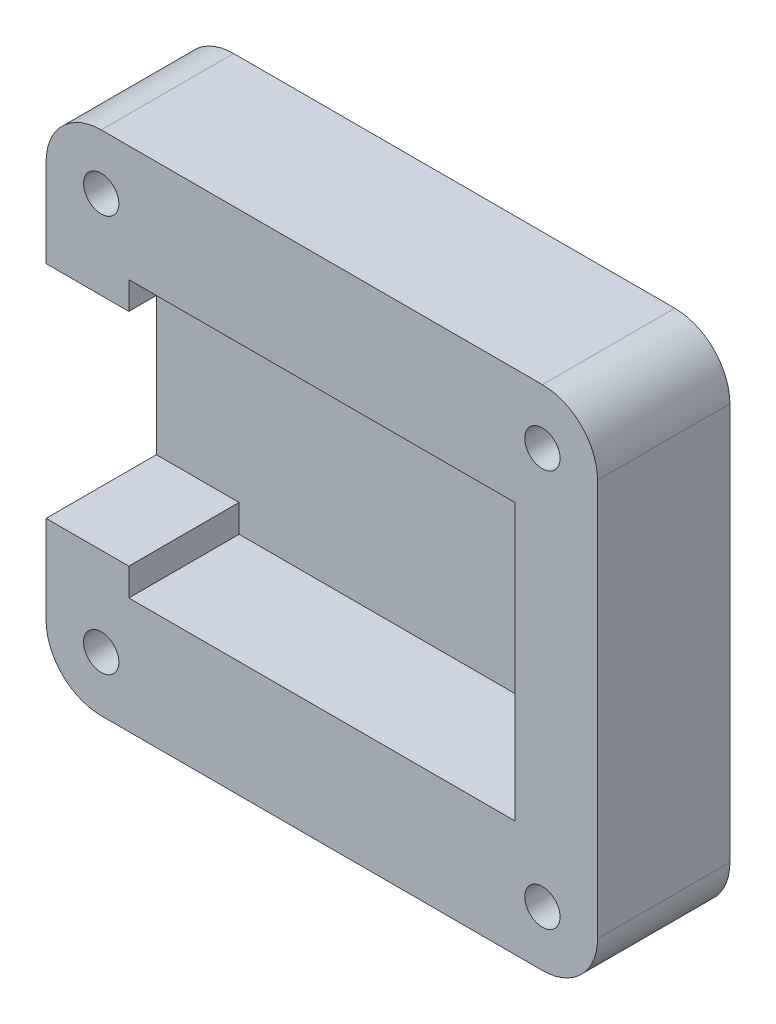
ISO-10303-21;
HEADER;
FILE_DESCRIPTION(('STEP AP214'),'2;1');
FILE_NAME('part.step','',(''),(''),'','','');
FILE_SCHEMA(('AUTOMOTIVE_DESIGN { 1 0 10303 214 1 1 1 1 }'));
ENDSEC;
DATA;
#1=APPLICATION_CONTEXT('core data for automotive mechanical design processes');
#2=APPLICATION_PROTOCOL_DEFINITION('international standard','automotive_design',2000,#1);
#3=PRODUCT_CONTEXT('',#1,'mechanical');
#4=PRODUCT('Part','Part','',(#3));
#5=PRODUCT_RELATED_PRODUCT_CATEGORY('part','',(#4));
#6=PRODUCT_DEFINITION_FORMATION('','',#4);
#7=PRODUCT_DEFINITION_CONTEXT('part definition',#1,'design');
#8=PRODUCT_DEFINITION('design','',#6,#7);
#9=PRODUCT_DEFINITION_SHAPE('','',#8);
#10=(LENGTH_UNIT() NAMED_UNIT(*) SI_UNIT(.MILLI.,.METRE.));
#11=(NAMED_UNIT(*) PLANE_ANGLE_UNIT() SI_UNIT($,.RADIAN.));
#12=(NAMED_UNIT(*) SI_UNIT($,.STERADIAN.) SOLID_ANGLE_UNIT());
#13=UNCERTAINTY_MEASURE_WITH_UNIT(LENGTH_MEASURE(1.E-05),#10,'distance_accuracy_value','');
#14=(GEOMETRIC_REPRESENTATION_CONTEXT(3) GLOBAL_UNCERTAINTY_ASSIGNED_CONTEXT((#13)) GLOBAL_UNIT_ASSIGNED_CONTEXT((#10,
#11,#12)) REPRESENTATION_CONTEXT('',''));
#15=CARTESIAN_POINT('',(0.,0.,0.));
#16=DIRECTION('',(0.,0.,1.));
#17=DIRECTION('',(1.,0.,0.));
#18=AXIS2_PLACEMENT_3D('',#15,#16,#17);
#19=CARTESIAN_POINT('',(-8.75,6.25,-5.));
#20=DIRECTION('',(-1.,0.,0.));
#21=DIRECTION('',(0.,0.,1.));
#22=AXIS2_PLACEMENT_3D('',#19,#20,#21);
#23=PLANE('',#22);
#24=DIRECTION('',(0.,-1.,0.));
#25=VECTOR('',#24,1.);
#26=CARTESIAN_POINT('',(-8.75,6.25,-5.));
#27=LINE('',#26,#25);
#28=CARTESIAN_POINT('',(-8.75,-5.,-5.));
#29=VERTEX_POINT('',#28);
#30=CARTESIAN_POINT('',(-8.75,-6.25,-5.));
#31=VERTEX_POINT('',#30);
#32=EDGE_CURVE('E198',#29,#31,#27,.T.);
#33=ORIENTED_EDGE('',*,*,#32,.F.);
#34=DIRECTION('',(0.,0.,1.));
#35=VECTOR('',#34,1.);
#36=CARTESIAN_POINT('',(-8.75,-5.,-15.6800046816469));
#37=LINE('',#36,#35);
#38=CARTESIAN_POINT('',(-8.75,-5.,0.));
#39=VERTEX_POINT('',#38);
#40=EDGE_CURVE('E184',#29,#39,#37,.T.);
#41=ORIENTED_EDGE('',*,*,#40,.T.);
#42=DIRECTION('',(0.,-1.,0.));
#43=VECTOR('',#42,1.);
#44=CARTESIAN_POINT('',(-8.75,6.25,0.));
#45=LINE('',#44,#43);
#46=CARTESIAN_POINT('',(-8.75,-6.25,0.));
#47=VERTEX_POINT('',#46);
#48=EDGE_CURVE('E211',#39,#47,#45,.T.);
#49=ORIENTED_EDGE('',*,*,#48,.T.);
#50=DIRECTION('',(0.,0.,1.));
#51=VECTOR('',#50,1.);
#52=CARTESIAN_POINT('',(-8.75,-6.25,-5.));
#53=LINE('',#52,#51);
#54=EDGE_CURVE('E215',#31,#47,#53,.T.);
#55=ORIENTED_EDGE('',*,*,#54,.F.);
#56=EDGE_LOOP('',(#33,#41,#49,#55));
#57=FACE_BOUND('',#56,.T.);
#58=ADVANCED_FACE('F35',(#57),#23,.F.);
#59=CARTESIAN_POINT('',(0.,0.,0.));
#60=DIRECTION('',(0.,0.,1.));
#61=DIRECTION('',(1.,0.,0.));
#62=AXIS2_PLACEMENT_3D('',#59,#60,#61);
#63=PLANE('',#62);
#64=CARTESIAN_POINT('',(10.,9.,0.));
#65=DIRECTION('',(0.,0.,-1.));
#66=DIRECTION('',(-1.,0.,0.));
#67=AXIS2_PLACEMENT_3D('',#64,#65,#66);
#68=CIRCLE('',#67,0.799999999999999);
#69=CARTESIAN_POINT('',(9.2,9.,0.));
#70=VERTEX_POINT('',#69);
#71=EDGE_CURVE('E582',#70,#70,#68,.T.);
#72=ORIENTED_EDGE('',*,*,#71,.T.);
#73=EDGE_LOOP('',(#72));
#74=FACE_BOUND('',#73,.T.);
#75=CARTESIAN_POINT('',(-10.,9.,0.));
#76=DIRECTION('',(0.,0.,-1.));
#77=DIRECTION('',(-1.,0.,0.));
#78=AXIS2_PLACEMENT_3D('',#75,#76,#77);
#79=CIRCLE('',#78,0.799999999999999);
#80=CARTESIAN_POINT('',(-10.8,9.,0.));
#81=VERTEX_POINT('',#80);
#82=EDGE_CURVE('E573',#81,#81,#79,.T.);
#83=ORIENTED_EDGE('',*,*,#82,.T.);
#84=EDGE_LOOP('',(#83));
#85=FACE_BOUND('',#84,.T.);
#86=CARTESIAN_POINT('',(-10.,-9.,0.));
#87=DIRECTION('',(0.,0.,-1.));
#88=DIRECTION('',(-1.,0.,0.));
#89=AXIS2_PLACEMENT_3D('',#86,#87,#88);
#90=CIRCLE('',#89,0.799999999999999);
#91=CARTESIAN_POINT('',(-10.8,-9.,0.));
#92=VERTEX_POINT('',#91);
#93=EDGE_CURVE('E562',#92,#92,#90,.T.);
#94=ORIENTED_EDGE('',*,*,#93,.T.);
#95=EDGE_LOOP('',(#94));
#96=FACE_BOUND('',#95,.T.);
#97=CARTESIAN_POINT('',(10.,-9.,0.));
#98=DIRECTION('',(0.,0.,-1.));
#99=DIRECTION('',(-1.,0.,0.));
#100=AXIS2_PLACEMENT_3D('',#97,#98,#99);
#101=CIRCLE('',#100,0.799999999999999);
#102=CARTESIAN_POINT('',(9.2,-9.,0.));
#103=VERTEX_POINT('',#102);
#104=EDGE_CURVE('E294',#103,#103,#101,.T.);
#105=ORIENTED_EDGE('',*,*,#104,.T.);
#106=EDGE_LOOP('',(#105));
#107=FACE_BOUND('',#106,.T.);
#108=DIRECTION('',(1.,0.,0.));
#109=VECTOR('',#108,1.);
#110=CARTESIAN_POINT('',(-12.5,11.5,0.));
#111=LINE('',#110,#109);
#112=CARTESIAN_POINT('',(-10.,11.5,0.));
#113=VERTEX_POINT('',#112);
#114=CARTESIAN_POINT('',(9.99999999999999,11.5,0.));
#115=VERTEX_POINT('',#114);
#116=EDGE_CURVE('E227',#113,#115,#111,.T.);
#117=ORIENTED_EDGE('',*,*,#116,.F.);
#118=CARTESIAN_POINT('',(-10.,9.00000000000001,0.));
#119=DIRECTION('',(0.,0.,1.));
#120=DIRECTION('',(1.,0.,0.));
#121=AXIS2_PLACEMENT_3D('',#118,#119,#120);
#122=CIRCLE('',#121,2.5);
#123=CARTESIAN_POINT('',(-12.5,9.00000000000001,0.));
#124=VERTEX_POINT('',#123);
#125=EDGE_CURVE('E156',#113,#124,#122,.T.);
#126=ORIENTED_EDGE('',*,*,#125,.T.);
#127=DIRECTION('',(0.,-1.,0.));
#128=VECTOR('',#127,1.);
#129=CARTESIAN_POINT('',(-12.5,11.5,0.));
#130=LINE('',#129,#128);
#131=CARTESIAN_POINT('',(-12.5,5.,0.));
#132=VERTEX_POINT('',#131);
#133=EDGE_CURVE('E149',#124,#132,#130,.T.);
#134=ORIENTED_EDGE('',*,*,#133,.T.);
#135=DIRECTION('',(-1.,0.,0.));
#136=VECTOR('',#135,1.);
#137=CARTESIAN_POINT('',(-12.5,5.,0.));
#138=LINE('',#137,#136);
#139=CARTESIAN_POINT('',(-8.75,5.,0.));
#140=VERTEX_POINT('',#139);
#141=EDGE_CURVE('E154',#140,#132,#138,.T.);
#142=ORIENTED_EDGE('',*,*,#141,.F.);
#143=CARTESIAN_POINT('',(-8.75,6.25,0.));
#144=VERTEX_POINT('',#143);
#145=EDGE_CURVE('E193',#144,#140,#45,.T.);
#146=ORIENTED_EDGE('',*,*,#145,.F.);
#147=DIRECTION('',(1.,0.,0.));
#148=VECTOR('',#147,1.);
#149=CARTESIAN_POINT('',(-8.75,6.25,0.));
#150=LINE('',#149,#148);
#151=CARTESIAN_POINT('',(8.75,6.25,0.));
#152=VERTEX_POINT('',#151);
#153=EDGE_CURVE('E188',#144,#152,#150,.T.);
#154=ORIENTED_EDGE('',*,*,#153,.T.);
#155=DIRECTION('',(0.,-1.,0.));
#156=VECTOR('',#155,1.);
#157=CARTESIAN_POINT('',(8.75,6.25,0.));
#158=LINE('',#157,#156);
#159=CARTESIAN_POINT('',(8.75,-6.25,0.));
#160=VERTEX_POINT('',#159);
#161=EDGE_CURVE('E205',#152,#160,#158,.T.);
#162=ORIENTED_EDGE('',*,*,#161,.T.);
#163=DIRECTION('',(1.,0.,0.));
#164=VECTOR('',#163,1.);
#165=CARTESIAN_POINT('',(-8.75,-6.25,0.));
#166=LINE('',#165,#164);
#167=EDGE_CURVE('E208',#47,#160,#166,.T.);
#168=ORIENTED_EDGE('',*,*,#167,.F.);
#169=ORIENTED_EDGE('',*,*,#48,.F.);
#170=DIRECTION('',(1.,0.,0.));
#171=VECTOR('',#170,1.);
#172=CARTESIAN_POINT('',(-12.5,-5.,0.));
#173=LINE('',#172,#171);
#174=CARTESIAN_POINT('',(-12.5,-5.,0.));
#175=VERTEX_POINT('',#174);
#176=EDGE_CURVE('E170',#175,#39,#173,.T.);
#177=ORIENTED_EDGE('',*,*,#176,.F.);
#178=CARTESIAN_POINT('',(-12.5,-9.00000000000001,0.));
#179=VERTEX_POINT('',#178);
#180=EDGE_CURVE('E161',#175,#179,#130,.T.);
#181=ORIENTED_EDGE('',*,*,#180,.T.);
#182=CARTESIAN_POINT('',(-10.,-9.00000000000001,0.));
#183=DIRECTION('',(0.,0.,1.));
#184=DIRECTION('',(1.,0.,0.));
#185=AXIS2_PLACEMENT_3D('',#182,#183,#184);
#186=CIRCLE('',#185,2.5);
#187=CARTESIAN_POINT('',(-10.,-11.5,0.));
#188=VERTEX_POINT('',#187);
#189=EDGE_CURVE('E250',#179,#188,#186,.T.);
#190=ORIENTED_EDGE('',*,*,#189,.T.);
#191=DIRECTION('',(1.,0.,0.));
#192=VECTOR('',#191,1.);
#193=CARTESIAN_POINT('',(-12.5,-11.5,0.));
#194=LINE('',#193,#192);
#195=CARTESIAN_POINT('',(9.99999999999999,-11.5,0.));
#196=VERTEX_POINT('',#195);
#197=EDGE_CURVE('E160',#188,#196,#194,.T.);
#198=ORIENTED_EDGE('',*,*,#197,.T.);
#199=CARTESIAN_POINT('',(10.,-9.00000000000001,0.));
#200=DIRECTION('',(0.,0.,1.));
#201=DIRECTION('',(1.,0.,0.));
#202=AXIS2_PLACEMENT_3D('',#199,#200,#201);
#203=CIRCLE('',#202,2.5);
#204=CARTESIAN_POINT('',(12.5,-9.00000000000001,0.));
#205=VERTEX_POINT('',#204);
#206=EDGE_CURVE('E248',#196,#205,#203,.T.);
#207=ORIENTED_EDGE('',*,*,#206,.T.);
#208=DIRECTION('',(0.,-1.,0.));
#209=VECTOR('',#208,1.);
#210=CARTESIAN_POINT('',(12.5,11.5,0.));
#211=LINE('',#210,#209);
#212=CARTESIAN_POINT('',(12.5,9.00000000000001,0.));
#213=VERTEX_POINT('',#212);
#214=EDGE_CURVE('E237',#213,#205,#211,.T.);
#215=ORIENTED_EDGE('',*,*,#214,.F.);
#216=CARTESIAN_POINT('',(10.,9.00000000000001,0.));
#217=DIRECTION('',(0.,0.,1.));
#218=DIRECTION('',(1.,0.,0.));
#219=AXIS2_PLACEMENT_3D('',#216,#217,#218);
#220=CIRCLE('',#219,2.5);
#221=EDGE_CURVE('E246',#213,#115,#220,.T.);
#222=ORIENTED_EDGE('',*,*,#221,.T.);
#223=EDGE_LOOP('',(#117,#126,#134,#142,#146,#154,#162,#168,#169,#177,#181,#190,#198,#207,#215,#222));
#224=FACE_BOUND('',#223,.T.);
#225=ADVANCED_FACE('F152',(#74,#85,#96,#107,#224),#63,.T.);
#226=CARTESIAN_POINT('',(-12.5,11.5,-6.));
#227=DIRECTION('',(-1.,0.,0.));
#228=DIRECTION('',(0.,0.,1.));
#229=AXIS2_PLACEMENT_3D('',#226,#227,#228);
#230=PLANE('',#229);
#231=ORIENTED_EDGE('',*,*,#133,.F.);
#232=DIRECTION('',(0.,0.,1.));
#233=VECTOR('',#232,1.);
#234=CARTESIAN_POINT('',(-12.5,9.00000000000001,-6.));
#235=LINE('',#234,#233);
#236=CARTESIAN_POINT('',(-12.5,9.00000000000001,-6.));
#237=VERTEX_POINT('',#236);
#238=EDGE_CURVE('E256',#124,#237,#235,.F.);
#239=ORIENTED_EDGE('',*,*,#238,.T.);
#240=DIRECTION('',(0.,-1.,0.));
#241=VECTOR('',#240,1.);
#242=CARTESIAN_POINT('',(-12.5,11.5,-6.));
#243=LINE('',#242,#241);
#244=CARTESIAN_POINT('',(-12.5,-9.00000000000001,-6.));
#245=VERTEX_POINT('',#244);
#246=EDGE_CURVE('E223',#237,#245,#243,.T.);
#247=ORIENTED_EDGE('',*,*,#246,.T.);
#248=DIRECTION('',(0.,0.,1.));
#249=VECTOR('',#248,1.);
#250=CARTESIAN_POINT('',(-12.5,-9.00000000000001,-6.));
#251=LINE('',#250,#249);
#252=EDGE_CURVE('E253',#245,#179,#251,.T.);
#253=ORIENTED_EDGE('',*,*,#252,.T.);
#254=ORIENTED_EDGE('',*,*,#180,.F.);
#255=DIRECTION('',(0.,0.,1.));
#256=VECTOR('',#255,1.);
#257=CARTESIAN_POINT('',(-12.5,-5.,-15.6800046816469));
#258=LINE('',#257,#256);
#259=CARTESIAN_POINT('',(-12.5,-5.,-5.));
#260=VERTEX_POINT('',#259);
#261=EDGE_CURVE('E179',#260,#175,#258,.T.);
#262=ORIENTED_EDGE('',*,*,#261,.F.);
#263=DIRECTION('',(0.,-1.,0.));
#264=VECTOR('',#263,1.);
#265=CARTESIAN_POINT('',(-12.5,5.,-5.));
#266=LINE('',#265,#264);
#267=CARTESIAN_POINT('',(-12.5,5.,-5.));
#268=VERTEX_POINT('',#267);
#269=EDGE_CURVE('E176',#268,#260,#266,.T.);
#270=ORIENTED_EDGE('',*,*,#269,.F.);
#271=DIRECTION('',(0.,0.,1.));
#272=VECTOR('',#271,1.);
#273=CARTESIAN_POINT('',(-12.5,5.,-15.6800046816469));
#274=LINE('',#273,#272);
#275=EDGE_CURVE('E165',#268,#132,#274,.T.);
#276=ORIENTED_EDGE('',*,*,#275,.T.);
#277=EDGE_LOOP('',(#231,#239,#247,#253,#254,#262,#270,#276));
#278=FACE_BOUND('',#277,.T.);
#279=ADVANCED_FACE('F173',(#278),#230,.T.);
#280=CARTESIAN_POINT('',(-12.5,11.5,-6.));
#281=DIRECTION('',(0.,-1.,0.));
#282=DIRECTION('',(0.,0.,-1.));
#283=AXIS2_PLACEMENT_3D('',#280,#281,#282);
#284=PLANE('',#283);
#285=DIRECTION('',(1.,0.,0.));
#286=VECTOR('',#285,1.);
#287=CARTESIAN_POINT('',(-12.5,11.5,-6.));
#288=LINE('',#287,#286);
#289=CARTESIAN_POINT('',(-10.,11.5,-6.));
#290=VERTEX_POINT('',#289);
#291=CARTESIAN_POINT('',(9.99999999999999,11.5,-6.));
#292=VERTEX_POINT('',#291);
#293=EDGE_CURVE('E231',#290,#292,#288,.T.);
#294=ORIENTED_EDGE('',*,*,#293,.F.);
#295=DIRECTION('',(0.,0.,1.));
#296=VECTOR('',#295,1.);
#297=CARTESIAN_POINT('',(-10.,11.5,0.));
#298=LINE('',#297,#296);
#299=EDGE_CURVE('E243',#290,#113,#298,.T.);
#300=ORIENTED_EDGE('',*,*,#299,.T.);
#301=ORIENTED_EDGE('',*,*,#116,.T.);
#302=DIRECTION('',(0.,0.,1.));
#303=VECTOR('',#302,1.);
#304=CARTESIAN_POINT('',(10.,11.5,-6.));
#305=LINE('',#304,#303);
#306=EDGE_CURVE('E233',#115,#292,#305,.F.);
#307=ORIENTED_EDGE('',*,*,#306,.T.);
#308=EDGE_LOOP('',(#294,#300,#301,#307));
#309=FACE_BOUND('',#308,.T.);
#310=ADVANCED_FACE('F336',(#309),#284,.F.);
#311=CARTESIAN_POINT('',(12.5,11.5,-6.));
#312=DIRECTION('',(-1.,0.,0.));
#313=DIRECTION('',(0.,0.,1.));
#314=AXIS2_PLACEMENT_3D('',#311,#312,#313);
#315=PLANE('',#314);
#316=ORIENTED_EDGE('',*,*,#214,.T.);
#317=DIRECTION('',(0.,0.,1.));
#318=VECTOR('',#317,1.);
#319=CARTESIAN_POINT('',(12.5,-9.00000000000001,-6.));
#320=LINE('',#319,#318);
#321=CARTESIAN_POINT('',(12.5,-9.00000000000001,-6.));
#322=VERTEX_POINT('',#321);
#323=EDGE_CURVE('E11',#205,#322,#320,.F.);
#324=ORIENTED_EDGE('',*,*,#323,.T.);
#325=DIRECTION('',(0.,-1.,0.));
#326=VECTOR('',#325,1.);
#327=CARTESIAN_POINT('',(12.5,11.5,-6.));
#328=LINE('',#327,#326);
#329=CARTESIAN_POINT('',(12.5,9.00000000000001,-6.));
#330=VERTEX_POINT('',#329);
#331=EDGE_CURVE('E229',#330,#322,#328,.T.);
#332=ORIENTED_EDGE('',*,*,#331,.F.);
#333=DIRECTION('',(0.,0.,1.));
#334=VECTOR('',#333,1.);
#335=CARTESIAN_POINT('',(12.5,9.00000000000001,-6.));
#336=LINE('',#335,#334);
#337=EDGE_CURVE('E43',#330,#213,#336,.T.);
#338=ORIENTED_EDGE('',*,*,#337,.T.);
#339=EDGE_LOOP('',(#316,#324,#332,#338));
#340=FACE_BOUND('',#339,.T.);
#341=ADVANCED_FACE('F273',(#340),#315,.F.);
#342=CARTESIAN_POINT('',(-12.5,-11.5,-6.));
#343=DIRECTION('',(0.,-1.,0.));
#344=DIRECTION('',(0.,0.,-1.));
#345=AXIS2_PLACEMENT_3D('',#342,#343,#344);
#346=PLANE('',#345);
#347=ORIENTED_EDGE('',*,*,#197,.F.);
#348=DIRECTION('',(0.,0.,1.));
#349=VECTOR('',#348,1.);
#350=CARTESIAN_POINT('',(-10.,-11.5,-6.));
#351=LINE('',#350,#349);
#352=CARTESIAN_POINT('',(-10.,-11.5,-6.));
#353=VERTEX_POINT('',#352);
#354=EDGE_CURVE('E57',#188,#353,#351,.F.);
#355=ORIENTED_EDGE('',*,*,#354,.T.);
#356=DIRECTION('',(1.,0.,0.));
#357=VECTOR('',#356,1.);
#358=CARTESIAN_POINT('',(-12.5,-11.5,-6.));
#359=LINE('',#358,#357);
#360=CARTESIAN_POINT('',(9.99999999999999,-11.5,-6.));
#361=VERTEX_POINT('',#360);
#362=EDGE_CURVE('E226',#353,#361,#359,.T.);
#363=ORIENTED_EDGE('',*,*,#362,.T.);
#364=DIRECTION('',(0.,0.,1.));
#365=VECTOR('',#364,1.);
#366=CARTESIAN_POINT('',(10.,-11.5,0.));
#367=LINE('',#366,#365);
#368=EDGE_CURVE('E265',#361,#196,#367,.T.);
#369=ORIENTED_EDGE('',*,*,#368,.T.);
#370=EDGE_LOOP('',(#347,#355,#363,#369));
#371=FACE_BOUND('',#370,.T.);
#372=ADVANCED_FACE('F280',(#371),#346,.T.);
#373=CARTESIAN_POINT('',(0.,0.,-6.));
#374=DIRECTION('',(0.,0.,1.));
#375=DIRECTION('',(1.,0.,0.));
#376=AXIS2_PLACEMENT_3D('',#373,#374,#375);
#377=PLANE('',#376);
#378=CARTESIAN_POINT('',(10.,9.,-6.));
#379=DIRECTION('',(0.,0.,-1.));
#380=DIRECTION('',(-1.,0.,0.));
#381=AXIS2_PLACEMENT_3D('',#378,#379,#380);
#382=CIRCLE('',#381,1.75);
#383=CARTESIAN_POINT('',(8.25,9.,-6.));
#384=VERTEX_POINT('',#383);
#385=EDGE_CURVE('E587',#384,#384,#382,.T.);
#386=ORIENTED_EDGE('',*,*,#385,.F.);
#387=EDGE_LOOP('',(#386));
#388=FACE_BOUND('',#387,.T.);
#389=CARTESIAN_POINT('',(-10.,9.,-6.));
#390=DIRECTION('',(0.,0.,-1.));
#391=DIRECTION('',(-1.,0.,0.));
#392=AXIS2_PLACEMENT_3D('',#389,#390,#391);
#393=CIRCLE('',#392,1.75);
#394=CARTESIAN_POINT('',(-11.75,9.,-6.));
#395=VERTEX_POINT('',#394);
#396=EDGE_CURVE('E579',#395,#395,#393,.T.);
#397=ORIENTED_EDGE('',*,*,#396,.F.);
#398=EDGE_LOOP('',(#397));
#399=FACE_BOUND('',#398,.T.);
#400=CARTESIAN_POINT('',(-10.,-9.,-6.));
#401=DIRECTION('',(0.,0.,-1.));
#402=DIRECTION('',(-1.,0.,0.));
#403=AXIS2_PLACEMENT_3D('',#400,#401,#402);
#404=CIRCLE('',#403,1.75);
#405=CARTESIAN_POINT('',(-11.75,-9.,-6.));
#406=VERTEX_POINT('',#405);
#407=EDGE_CURVE('E570',#406,#406,#404,.T.);
#408=ORIENTED_EDGE('',*,*,#407,.F.);
#409=EDGE_LOOP('',(#408));
#410=FACE_BOUND('',#409,.T.);
#411=CARTESIAN_POINT('',(10.,-9.,-6.));
#412=DIRECTION('',(0.,0.,-1.));
#413=DIRECTION('',(-1.,0.,0.));
#414=AXIS2_PLACEMENT_3D('',#411,#412,#413);
#415=CIRCLE('',#414,1.75);
#416=CARTESIAN_POINT('',(8.25,-9.,-6.));
#417=VERTEX_POINT('',#416);
#418=EDGE_CURVE('E559',#417,#417,#415,.T.);
#419=ORIENTED_EDGE('',*,*,#418,.F.);
#420=EDGE_LOOP('',(#419));
#421=FACE_BOUND('',#420,.T.);
#422=ORIENTED_EDGE('',*,*,#246,.F.);
#423=CARTESIAN_POINT('',(-10.,9.00000000000001,-6.));
#424=DIRECTION('',(0.,0.,1.));
#425=DIRECTION('',(1.,0.,0.));
#426=AXIS2_PLACEMENT_3D('',#423,#424,#425);
#427=CIRCLE('',#426,2.5);
#428=EDGE_CURVE('E263',#237,#290,#427,.F.);
#429=ORIENTED_EDGE('',*,*,#428,.T.);
#430=ORIENTED_EDGE('',*,*,#293,.T.);
#431=CARTESIAN_POINT('',(10.,9.00000000000001,-6.));
#432=DIRECTION('',(0.,0.,1.));
#433=DIRECTION('',(1.,0.,0.));
#434=AXIS2_PLACEMENT_3D('',#431,#432,#433);
#435=CIRCLE('',#434,2.5);
#436=EDGE_CURVE('E258',#292,#330,#435,.F.);
#437=ORIENTED_EDGE('',*,*,#436,.T.);
#438=ORIENTED_EDGE('',*,*,#331,.T.);
#439=CARTESIAN_POINT('',(10.,-9.00000000000001,-6.));
#440=DIRECTION('',(0.,0.,1.));
#441=DIRECTION('',(1.,0.,0.));
#442=AXIS2_PLACEMENT_3D('',#439,#440,#441);
#443=CIRCLE('',#442,2.5);
#444=EDGE_CURVE('E50',#322,#361,#443,.F.);
#445=ORIENTED_EDGE('',*,*,#444,.T.);
#446=ORIENTED_EDGE('',*,*,#362,.F.);
#447=CARTESIAN_POINT('',(-10.,-9.00000000000001,-6.));
#448=DIRECTION('',(0.,0.,1.));
#449=DIRECTION('',(1.,0.,0.));
#450=AXIS2_PLACEMENT_3D('',#447,#448,#449);
#451=CIRCLE('',#450,2.5);
#452=EDGE_CURVE('E261',#353,#245,#451,.F.);
#453=ORIENTED_EDGE('',*,*,#452,.T.);
#454=EDGE_LOOP('',(#422,#429,#430,#437,#438,#445,#446,#453));
#455=FACE_BOUND('',#454,.T.);
#456=ADVANCED_FACE('F283',(#388,#399,#410,#421,#455),#377,.F.);
#457=CARTESIAN_POINT('',(-8.75,6.25,-5.));
#458=DIRECTION('',(0.,-1.,0.));
#459=DIRECTION('',(0.,0.,-1.));
#460=AXIS2_PLACEMENT_3D('',#457,#458,#459);
#461=PLANE('',#460);
#462=ORIENTED_EDGE('',*,*,#153,.F.);
#463=DIRECTION('',(0.,0.,1.));
#464=VECTOR('',#463,1.);
#465=CARTESIAN_POINT('',(-8.75,6.25,-5.));
#466=LINE('',#465,#464);
#467=CARTESIAN_POINT('',(-8.75,6.25,-5.));
#468=VERTEX_POINT('',#467);
#469=EDGE_CURVE('E202',#468,#144,#466,.T.);
#470=ORIENTED_EDGE('',*,*,#469,.F.);
#471=DIRECTION('',(1.,0.,0.));
#472=VECTOR('',#471,1.);
#473=CARTESIAN_POINT('',(-8.75,6.25,-5.));
#474=LINE('',#473,#472);
#475=CARTESIAN_POINT('',(8.75,6.25,-5.));
#476=VERTEX_POINT('',#475);
#477=EDGE_CURVE('E189',#468,#476,#474,.T.);
#478=ORIENTED_EDGE('',*,*,#477,.T.);
#479=DIRECTION('',(0.,0.,1.));
#480=VECTOR('',#479,1.);
#481=CARTESIAN_POINT('',(8.75,6.25,-5.));
#482=LINE('',#481,#480);
#483=EDGE_CURVE('E220',#476,#152,#482,.T.);
#484=ORIENTED_EDGE('',*,*,#483,.T.);
#485=EDGE_LOOP('',(#462,#470,#478,#484));
#486=FACE_BOUND('',#485,.T.);
#487=ADVANCED_FACE('F315',(#486),#461,.T.);
#488=CARTESIAN_POINT('',(8.75,6.25,-5.));
#489=DIRECTION('',(-1.,0.,0.));
#490=DIRECTION('',(0.,0.,1.));
#491=AXIS2_PLACEMENT_3D('',#488,#489,#490);
#492=PLANE('',#491);
#493=ORIENTED_EDGE('',*,*,#161,.F.);
#494=ORIENTED_EDGE('',*,*,#483,.F.);
#495=DIRECTION('',(0.,-1.,0.));
#496=VECTOR('',#495,1.);
#497=CARTESIAN_POINT('',(8.75,6.25,-5.));
#498=LINE('',#497,#496);
#499=CARTESIAN_POINT('',(8.75,-6.25,-5.));
#500=VERTEX_POINT('',#499);
#501=EDGE_CURVE('E192',#476,#500,#498,.T.);
#502=ORIENTED_EDGE('',*,*,#501,.T.);
#503=DIRECTION('',(0.,0.,1.));
#504=VECTOR('',#503,1.);
#505=CARTESIAN_POINT('',(8.75,-6.25,-5.));
#506=LINE('',#505,#504);
#507=EDGE_CURVE('E218',#500,#160,#506,.T.);
#508=ORIENTED_EDGE('',*,*,#507,.T.);
#509=EDGE_LOOP('',(#493,#494,#502,#508));
#510=FACE_BOUND('',#509,.T.);
#511=ADVANCED_FACE('F316',(#510),#492,.T.);
#512=CARTESIAN_POINT('',(-8.75,-6.25,-5.));
#513=DIRECTION('',(0.,-1.,0.));
#514=DIRECTION('',(0.,0.,-1.));
#515=AXIS2_PLACEMENT_3D('',#512,#513,#514);
#516=PLANE('',#515);
#517=ORIENTED_EDGE('',*,*,#167,.T.);
#518=ORIENTED_EDGE('',*,*,#507,.F.);
#519=DIRECTION('',(1.,0.,0.));
#520=VECTOR('',#519,1.);
#521=CARTESIAN_POINT('',(-8.75,-6.25,-5.));
#522=LINE('',#521,#520);
#523=EDGE_CURVE('E195',#31,#500,#522,.T.);
#524=ORIENTED_EDGE('',*,*,#523,.F.);
#525=ORIENTED_EDGE('',*,*,#54,.T.);
#526=EDGE_LOOP('',(#517,#518,#524,#525));
#527=FACE_BOUND('',#526,.T.);
#528=ADVANCED_FACE('F310',(#527),#516,.F.);
#529=ORIENTED_EDGE('',*,*,#145,.T.);
#530=DIRECTION('',(0.,0.,1.));
#531=VECTOR('',#530,1.);
#532=CARTESIAN_POINT('',(-8.75,5.,-15.6800046816469));
#533=LINE('',#532,#531);
#534=CARTESIAN_POINT('',(-8.75,5.,-5.));
#535=VERTEX_POINT('',#534);
#536=EDGE_CURVE('E168',#535,#140,#533,.T.);
#537=ORIENTED_EDGE('',*,*,#536,.F.);
#538=EDGE_CURVE('E199',#468,#535,#27,.T.);
#539=ORIENTED_EDGE('',*,*,#538,.F.);
#540=ORIENTED_EDGE('',*,*,#469,.T.);
#541=EDGE_LOOP('',(#529,#537,#539,#540));
#542=FACE_BOUND('',#541,.T.);
#543=ADVANCED_FACE('F318',(#542),#23,.F.);
#544=CARTESIAN_POINT('',(0.,0.,-5.));
#545=DIRECTION('',(0.,0.,-1.));
#546=DIRECTION('',(-1.,0.,0.));
#547=AXIS2_PLACEMENT_3D('',#544,#545,#546);
#548=PLANE('',#547);
#549=ORIENTED_EDGE('',*,*,#477,.F.);
#550=ORIENTED_EDGE('',*,*,#538,.T.);
#551=DIRECTION('',(-1.,0.,0.));
#552=VECTOR('',#551,1.);
#553=CARTESIAN_POINT('',(-12.5,5.,-5.));
#554=LINE('',#553,#552);
#555=EDGE_CURVE('E177',#535,#268,#554,.T.);
#556=ORIENTED_EDGE('',*,*,#555,.T.);
#557=ORIENTED_EDGE('',*,*,#269,.T.);
#558=DIRECTION('',(1.,0.,0.));
#559=VECTOR('',#558,1.);
#560=CARTESIAN_POINT('',(-12.5,-5.,-5.));
#561=LINE('',#560,#559);
#562=EDGE_CURVE('E169',#260,#29,#561,.T.);
#563=ORIENTED_EDGE('',*,*,#562,.T.);
#564=ORIENTED_EDGE('',*,*,#32,.T.);
#565=ORIENTED_EDGE('',*,*,#523,.T.);
#566=ORIENTED_EDGE('',*,*,#501,.F.);
#567=EDGE_LOOP('',(#549,#550,#556,#557,#563,#564,#565,#566));
#568=FACE_BOUND('',#567,.T.);
#569=ADVANCED_FACE('F302',(#568),#548,.F.);
#570=CARTESIAN_POINT('',(-12.5,-5.,-15.6800046816469));
#571=DIRECTION('',(0.,-1.,0.));
#572=DIRECTION('',(1.,0.,0.));
#573=AXIS2_PLACEMENT_3D('',#570,#571,#572);
#574=PLANE('',#573);
#575=ORIENTED_EDGE('',*,*,#261,.T.);
#576=ORIENTED_EDGE('',*,*,#176,.T.);
#577=ORIENTED_EDGE('',*,*,#40,.F.);
#578=ORIENTED_EDGE('',*,*,#562,.F.);
#579=EDGE_LOOP('',(#575,#576,#577,#578));
#580=FACE_BOUND('',#579,.T.);
#581=ADVANCED_FACE('F305',(#580),#574,.F.);
#582=CARTESIAN_POINT('',(-12.5,5.,-15.6800046816469));
#583=DIRECTION('',(0.,1.,0.));
#584=DIRECTION('',(-1.,0.,0.));
#585=AXIS2_PLACEMENT_3D('',#582,#583,#584);
#586=PLANE('',#585);
#587=ORIENTED_EDGE('',*,*,#536,.T.);
#588=ORIENTED_EDGE('',*,*,#141,.T.);
#589=ORIENTED_EDGE('',*,*,#275,.F.);
#590=ORIENTED_EDGE('',*,*,#555,.F.);
#591=EDGE_LOOP('',(#587,#588,#589,#590));
#592=FACE_BOUND('',#591,.T.);
#593=ADVANCED_FACE('F164',(#592),#586,.F.);
#594=CARTESIAN_POINT('',(10.,-9.,-6.));
#595=DIRECTION('',(0.,0.,-1.));
#596=DIRECTION('',(-1.,0.,0.));
#597=AXIS2_PLACEMENT_3D('',#594,#595,#596);
#598=CYLINDRICAL_SURFACE('',#597,0.799999999999999);
#599=ORIENTED_EDGE('',*,*,#104,.F.);
#600=EDGE_LOOP('',(#599));
#601=FACE_BOUND('',#600,.T.);
#602=CARTESIAN_POINT('',(10.,-9.,-5.05));
#603=DIRECTION('',(0.,0.,-1.));
#604=DIRECTION('',(-1.,0.,0.));
#605=AXIS2_PLACEMENT_3D('',#602,#603,#604);
#606=CIRCLE('',#605,0.799999999999999);
#607=CARTESIAN_POINT('',(9.2,-9.,-5.05));
#608=VERTEX_POINT('',#607);
#609=EDGE_CURVE('E297',#608,#608,#606,.T.);
#610=ORIENTED_EDGE('',*,*,#609,.T.);
#611=EDGE_LOOP('',(#610));
#612=FACE_BOUND('',#611,.T.);
#613=ADVANCED_FACE('F489',(#601,#612),#598,.F.);
#614=CARTESIAN_POINT('',(10.,-9.,-6.));
#615=DIRECTION('',(0.,0.,-1.));
#616=DIRECTION('',(-1.,0.,0.));
#617=AXIS2_PLACEMENT_3D('',#614,#615,#616);
#618=CONICAL_SURFACE('',#617,1.75,0.785398163397448);
#619=ORIENTED_EDGE('',*,*,#609,.F.);
#620=EDGE_LOOP('',(#619));
#621=FACE_BOUND('',#620,.T.);
#622=ORIENTED_EDGE('',*,*,#418,.T.);
#623=EDGE_LOOP('',(#622));
#624=FACE_BOUND('',#623,.T.);
#625=ADVANCED_FACE('F479',(#621,#624),#618,.F.);
#626=CARTESIAN_POINT('',(-10.,-9.,-6.));
#627=DIRECTION('',(0.,0.,-1.));
#628=DIRECTION('',(-1.,0.,0.));
#629=AXIS2_PLACEMENT_3D('',#626,#627,#628);
#630=CYLINDRICAL_SURFACE('',#629,0.799999999999999);
#631=ORIENTED_EDGE('',*,*,#93,.F.);
#632=EDGE_LOOP('',(#631));
#633=FACE_BOUND('',#632,.T.);
#634=CARTESIAN_POINT('',(-10.,-9.,-5.05));
#635=DIRECTION('',(0.,0.,-1.));
#636=DIRECTION('',(-1.,0.,0.));
#637=AXIS2_PLACEMENT_3D('',#634,#635,#636);
#638=CIRCLE('',#637,0.799999999999999);
#639=CARTESIAN_POINT('',(-10.8,-9.,-5.05));
#640=VERTEX_POINT('',#639);
#641=EDGE_CURVE('E567',#640,#640,#638,.T.);
#642=ORIENTED_EDGE('',*,*,#641,.T.);
#643=EDGE_LOOP('',(#642));
#644=FACE_BOUND('',#643,.T.);
#645=ADVANCED_FACE('F469',(#633,#644),#630,.F.);
#646=CARTESIAN_POINT('',(-10.,-9.,-6.));
#647=DIRECTION('',(0.,0.,-1.));
#648=DIRECTION('',(-1.,0.,0.));
#649=AXIS2_PLACEMENT_3D('',#646,#647,#648);
#650=CONICAL_SURFACE('',#649,1.75,0.785398163397448);
#651=ORIENTED_EDGE('',*,*,#641,.F.);
#652=EDGE_LOOP('',(#651));
#653=FACE_BOUND('',#652,.T.);
#654=ORIENTED_EDGE('',*,*,#407,.T.);
#655=EDGE_LOOP('',(#654));
#656=FACE_BOUND('',#655,.T.);
#657=ADVANCED_FACE('F459',(#653,#656),#650,.F.);
#658=CARTESIAN_POINT('',(-10.,9.,-6.));
#659=DIRECTION('',(0.,0.,-1.));
#660=DIRECTION('',(-1.,0.,0.));
#661=AXIS2_PLACEMENT_3D('',#658,#659,#660);
#662=CYLINDRICAL_SURFACE('',#661,0.799999999999999);
#663=ORIENTED_EDGE('',*,*,#82,.F.);
#664=EDGE_LOOP('',(#663));
#665=FACE_BOUND('',#664,.T.);
#666=CARTESIAN_POINT('',(-10.,9.,-5.05));
#667=DIRECTION('',(0.,0.,-1.));
#668=DIRECTION('',(-1.,0.,0.));
#669=AXIS2_PLACEMENT_3D('',#666,#667,#668);
#670=CIRCLE('',#669,0.799999999999999);
#671=CARTESIAN_POINT('',(-10.8,9.,-5.05));
#672=VERTEX_POINT('',#671);
#673=EDGE_CURVE('E576',#672,#672,#670,.T.);
#674=ORIENTED_EDGE('',*,*,#673,.T.);
#675=EDGE_LOOP('',(#674));
#676=FACE_BOUND('',#675,.T.);
#677=ADVANCED_FACE('F449',(#665,#676),#662,.F.);
#678=CARTESIAN_POINT('',(-10.,9.,-6.));
#679=DIRECTION('',(0.,0.,-1.));
#680=DIRECTION('',(-1.,0.,0.));
#681=AXIS2_PLACEMENT_3D('',#678,#679,#680);
#682=CONICAL_SURFACE('',#681,1.75,0.785398163397448);
#683=ORIENTED_EDGE('',*,*,#673,.F.);
#684=EDGE_LOOP('',(#683));
#685=FACE_BOUND('',#684,.T.);
#686=ORIENTED_EDGE('',*,*,#396,.T.);
#687=EDGE_LOOP('',(#686));
#688=FACE_BOUND('',#687,.T.);
#689=ADVANCED_FACE('F439',(#685,#688),#682,.F.);
#690=CARTESIAN_POINT('',(10.,9.,-6.));
#691=DIRECTION('',(0.,0.,-1.));
#692=DIRECTION('',(-1.,0.,0.));
#693=AXIS2_PLACEMENT_3D('',#690,#691,#692);
#694=CYLINDRICAL_SURFACE('',#693,0.799999999999999);
#695=ORIENTED_EDGE('',*,*,#71,.F.);
#696=EDGE_LOOP('',(#695));
#697=FACE_BOUND('',#696,.T.);
#698=CARTESIAN_POINT('',(10.,9.,-5.05));
#699=DIRECTION('',(0.,0.,-1.));
#700=DIRECTION('',(-1.,0.,0.));
#701=AXIS2_PLACEMENT_3D('',#698,#699,#700);
#702=CIRCLE('',#701,0.799999999999999);
#703=CARTESIAN_POINT('',(9.2,9.,-5.05));
#704=VERTEX_POINT('',#703);
#705=EDGE_CURVE('E584',#704,#704,#702,.T.);
#706=ORIENTED_EDGE('',*,*,#705,.T.);
#707=EDGE_LOOP('',(#706));
#708=FACE_BOUND('',#707,.T.);
#709=ADVANCED_FACE('F429',(#697,#708),#694,.F.);
#710=CARTESIAN_POINT('',(10.,9.,-6.));
#711=DIRECTION('',(0.,0.,-1.));
#712=DIRECTION('',(-1.,0.,0.));
#713=AXIS2_PLACEMENT_3D('',#710,#711,#712);
#714=CONICAL_SURFACE('',#713,1.75,0.785398163397448);
#715=ORIENTED_EDGE('',*,*,#705,.F.);
#716=EDGE_LOOP('',(#715));
#717=FACE_BOUND('',#716,.T.);
#718=ORIENTED_EDGE('',*,*,#385,.T.);
#719=EDGE_LOOP('',(#718));
#720=FACE_BOUND('',#719,.T.);
#721=ADVANCED_FACE('F353',(#717,#720),#714,.F.);
#722=CARTESIAN_POINT('',(-10.,9.00000000000001,-6.));
#723=DIRECTION('',(0.,0.,-1.));
#724=DIRECTION('',(-1.,0.,0.));
#725=AXIS2_PLACEMENT_3D('',#722,#723,#724);
#726=CYLINDRICAL_SURFACE('',#725,2.5);
#727=ORIENTED_EDGE('',*,*,#428,.F.);
#728=ORIENTED_EDGE('',*,*,#238,.F.);
#729=ORIENTED_EDGE('',*,*,#125,.F.);
#730=ORIENTED_EDGE('',*,*,#299,.F.);
#731=EDGE_LOOP('',(#727,#728,#729,#730));
#732=FACE_BOUND('',#731,.T.);
#733=ADVANCED_FACE('F350',(#732),#726,.T.);
#734=CARTESIAN_POINT('',(-10.,-9.00000000000001,-6.));
#735=DIRECTION('',(0.,0.,1.));
#736=DIRECTION('',(1.,0.,0.));
#737=AXIS2_PLACEMENT_3D('',#734,#735,#736);
#738=CYLINDRICAL_SURFACE('',#737,2.5);
#739=ORIENTED_EDGE('',*,*,#452,.F.);
#740=ORIENTED_EDGE('',*,*,#354,.F.);
#741=ORIENTED_EDGE('',*,*,#189,.F.);
#742=ORIENTED_EDGE('',*,*,#252,.F.);
#743=EDGE_LOOP('',(#739,#740,#741,#742));
#744=FACE_BOUND('',#743,.T.);
#745=ADVANCED_FACE('F286',(#744),#738,.T.);
#746=CARTESIAN_POINT('',(10.,-9.00000000000001,-6.));
#747=DIRECTION('',(0.,0.,-1.));
#748=DIRECTION('',(-1.,0.,0.));
#749=AXIS2_PLACEMENT_3D('',#746,#747,#748);
#750=CYLINDRICAL_SURFACE('',#749,2.5);
#751=ORIENTED_EDGE('',*,*,#444,.F.);
#752=ORIENTED_EDGE('',*,*,#323,.F.);
#753=ORIENTED_EDGE('',*,*,#206,.F.);
#754=ORIENTED_EDGE('',*,*,#368,.F.);
#755=EDGE_LOOP('',(#751,#752,#753,#754));
#756=FACE_BOUND('',#755,.T.);
#757=ADVANCED_FACE('F279',(#756),#750,.T.);
#758=CARTESIAN_POINT('',(10.,9.00000000000001,-6.));
#759=DIRECTION('',(0.,0.,1.));
#760=DIRECTION('',(1.,0.,0.));
#761=AXIS2_PLACEMENT_3D('',#758,#759,#760);
#762=CYLINDRICAL_SURFACE('',#761,2.5);
#763=ORIENTED_EDGE('',*,*,#436,.F.);
#764=ORIENTED_EDGE('',*,*,#306,.F.);
#765=ORIENTED_EDGE('',*,*,#221,.F.);
#766=ORIENTED_EDGE('',*,*,#337,.F.);
#767=EDGE_LOOP('',(#763,#764,#765,#766));
#768=FACE_BOUND('',#767,.T.);
#769=ADVANCED_FACE('F37',(#768),#762,.T.);
#770=CLOSED_SHELL('',(#58,#225,#279,#310,#341,#372,#456,#487,#511,#528,#543,#569,#581,#593,#613,
#625,#645,#657,#677,#689,#709,#721,#733,#745,#757,#769));
#771=MANIFOLD_SOLID_BREP('B2',#770);
#772=ADVANCED_BREP_SHAPE_REPRESENTATION('',(#18,#771),#14);
#773=SHAPE_DEFINITION_REPRESENTATION(#9,#772);
ENDSEC;
END-ISO-10303-21;
